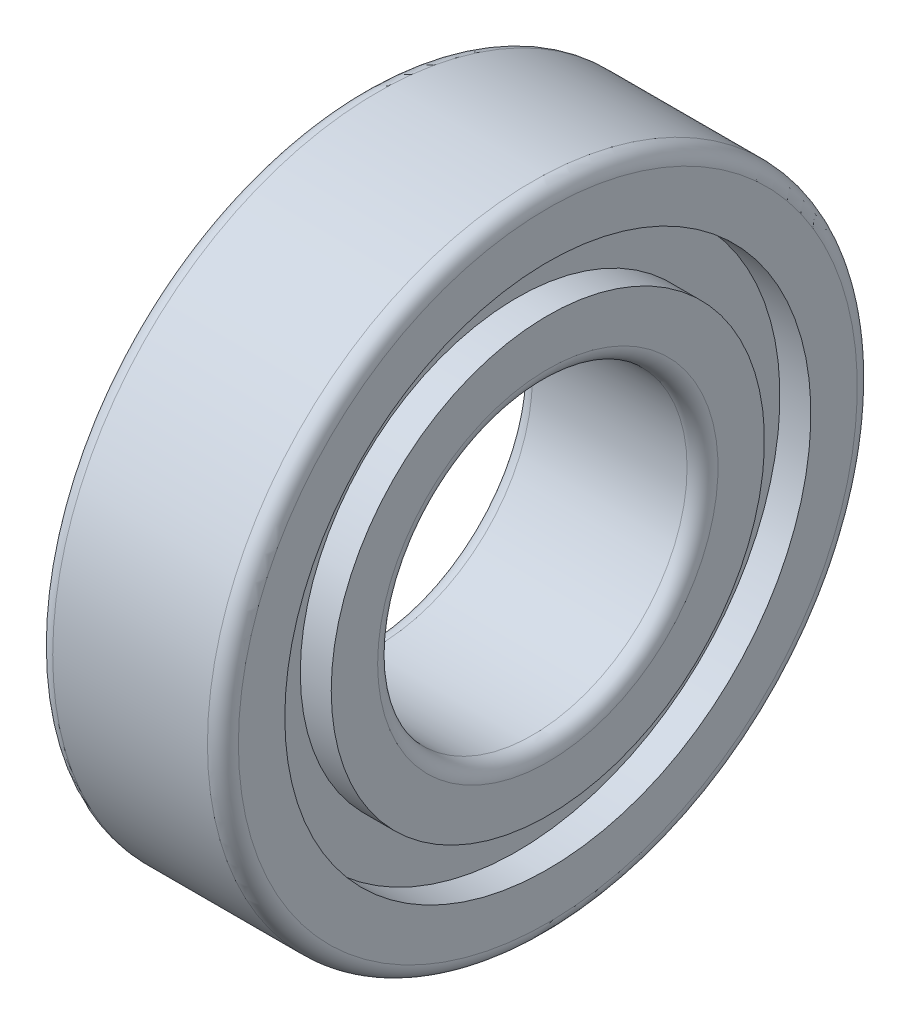
ISO-10303-21;
HEADER;
FILE_DESCRIPTION(('STEP AP214'),'2;1');
FILE_NAME('part.step','',(''),(''),'','','');
FILE_SCHEMA(('AUTOMOTIVE_DESIGN { 1 0 10303 214 1 1 1 1 }'));
ENDSEC;
DATA;
#1=APPLICATION_CONTEXT('core data for automotive mechanical design processes');
#2=APPLICATION_PROTOCOL_DEFINITION('international standard','automotive_design',2000,#1);
#3=PRODUCT_CONTEXT('',#1,'mechanical');
#4=PRODUCT('Part','Part','',(#3));
#5=PRODUCT_RELATED_PRODUCT_CATEGORY('part','',(#4));
#6=PRODUCT_DEFINITION_FORMATION('','',#4);
#7=PRODUCT_DEFINITION_CONTEXT('part definition',#1,'design');
#8=PRODUCT_DEFINITION('design','',#6,#7);
#9=PRODUCT_DEFINITION_SHAPE('','',#8);
#10=(LENGTH_UNIT() NAMED_UNIT(*) SI_UNIT(.MILLI.,.METRE.));
#11=(NAMED_UNIT(*) PLANE_ANGLE_UNIT() SI_UNIT($,.RADIAN.));
#12=(NAMED_UNIT(*) SI_UNIT($,.STERADIAN.) SOLID_ANGLE_UNIT());
#13=UNCERTAINTY_MEASURE_WITH_UNIT(LENGTH_MEASURE(1.E-05),#10,'distance_accuracy_value','');
#14=(GEOMETRIC_REPRESENTATION_CONTEXT(3) GLOBAL_UNCERTAINTY_ASSIGNED_CONTEXT((#13)) GLOBAL_UNIT_ASSIGNED_CONTEXT((#10,
#11,#12)) REPRESENTATION_CONTEXT('',''));
#15=CARTESIAN_POINT('',(0.,0.,0.));
#16=DIRECTION('',(0.,0.,1.));
#17=DIRECTION('',(1.,0.,0.));
#18=AXIS2_PLACEMENT_3D('',#15,#16,#17);
#19=CARTESIAN_POINT('',(-5.,0.,0.));
#20=DIRECTION('',(-1.,0.,0.));
#21=DIRECTION('',(0.,0.,1.));
#22=AXIS2_PLACEMENT_3D('',#19,#20,#21);
#23=TOROIDAL_SURFACE('',#22,11.,1.);
#24=CARTESIAN_POINT('',(-5.,0.,0.));
#25=DIRECTION('',(-1.,0.,0.));
#26=DIRECTION('',(0.,0.,1.));
#27=AXIS2_PLACEMENT_3D('',#24,#25,#26);
#28=CIRCLE('',#27,10.);
#29=CARTESIAN_POINT('',(-5.,0.,10.));
#30=VERTEX_POINT('',#29);
#31=EDGE_CURVE('E84',#30,#30,#28,.T.);
#32=ORIENTED_EDGE('',*,*,#31,.F.);
#33=EDGE_LOOP('',(#32));
#34=FACE_BOUND('',#33,.T.);
#35=CARTESIAN_POINT('',(-6.00000000000001,0.,0.));
#36=DIRECTION('',(-1.,0.,0.));
#37=DIRECTION('',(0.,0.,1.));
#38=AXIS2_PLACEMENT_3D('',#35,#36,#37);
#39=CIRCLE('',#38,11.);
#40=CARTESIAN_POINT('',(-6.00000000000001,0.,11.));
#41=VERTEX_POINT('',#40);
#42=EDGE_CURVE('E10',#41,#41,#39,.T.);
#43=ORIENTED_EDGE('',*,*,#42,.T.);
#44=EDGE_LOOP('',(#43));
#45=FACE_BOUND('',#44,.T.);
#46=ADVANCED_FACE('F32',(#34,#45),#23,.T.);
#47=CARTESIAN_POINT('',(-6.,11.,0.));
#48=DIRECTION('',(1.,0.,0.));
#49=DIRECTION('',(0.,0.,-1.));
#50=AXIS2_PLACEMENT_3D('',#47,#48,#49);
#51=PLANE('',#50);
#52=ORIENTED_EDGE('',*,*,#42,.F.);
#53=EDGE_LOOP('',(#52));
#54=FACE_BOUND('',#53,.T.);
#55=CARTESIAN_POINT('',(-6.00000000000001,0.,0.));
#56=DIRECTION('',(-1.,0.,0.));
#57=DIRECTION('',(0.,0.,1.));
#58=AXIS2_PLACEMENT_3D('',#55,#56,#57);
#59=CIRCLE('',#58,14.);
#60=CARTESIAN_POINT('',(-6.00000000000001,0.,14.));
#61=VERTEX_POINT('',#60);
#62=EDGE_CURVE('E38',#61,#61,#59,.T.);
#63=ORIENTED_EDGE('',*,*,#62,.T.);
#64=EDGE_LOOP('',(#63));
#65=FACE_BOUND('',#64,.T.);
#66=ADVANCED_FACE('F91',(#54,#65),#51,.F.);
#67=CARTESIAN_POINT('',(-1000.,0.,0.));
#68=DIRECTION('',(-1.,0.,0.));
#69=DIRECTION('',(0.,0.,1.));
#70=AXIS2_PLACEMENT_3D('',#67,#68,#69);
#71=CYLINDRICAL_SURFACE('',#70,14.);
#72=ORIENTED_EDGE('',*,*,#62,.F.);
#73=EDGE_LOOP('',(#72));
#74=FACE_BOUND('',#73,.T.);
#75=CARTESIAN_POINT('',(-4.,0.,0.));
#76=DIRECTION('',(-1.,0.,0.));
#77=DIRECTION('',(0.,0.,1.));
#78=AXIS2_PLACEMENT_3D('',#75,#76,#77);
#79=CIRCLE('',#78,14.);
#80=CARTESIAN_POINT('',(-4.,0.,14.));
#81=VERTEX_POINT('',#80);
#82=EDGE_CURVE('E42',#81,#81,#79,.T.);
#83=ORIENTED_EDGE('',*,*,#82,.T.);
#84=EDGE_LOOP('',(#83));
#85=FACE_BOUND('',#84,.T.);
#86=ADVANCED_FACE('F95',(#74,#85),#71,.T.);
#87=CARTESIAN_POINT('',(-4.,14.,0.));
#88=DIRECTION('',(1.,0.,0.));
#89=DIRECTION('',(0.,0.,-1.));
#90=AXIS2_PLACEMENT_3D('',#87,#88,#89);
#91=PLANE('',#90);
#92=ORIENTED_EDGE('',*,*,#82,.F.);
#93=EDGE_LOOP('',(#92));
#94=FACE_BOUND('',#93,.T.);
#95=CARTESIAN_POINT('',(-4.,0.,0.));
#96=DIRECTION('',(-1.,0.,0.));
#97=DIRECTION('',(0.,0.,1.));
#98=AXIS2_PLACEMENT_3D('',#95,#96,#97);
#99=CIRCLE('',#98,17.);
#100=CARTESIAN_POINT('',(-4.,0.,17.));
#101=VERTEX_POINT('',#100);
#102=EDGE_CURVE('E46',#101,#101,#99,.T.);
#103=ORIENTED_EDGE('',*,*,#102,.T.);
#104=EDGE_LOOP('',(#103));
#105=FACE_BOUND('',#104,.T.);
#106=ADVANCED_FACE('F100',(#94,#105),#91,.F.);
#107=CARTESIAN_POINT('',(-1000.,0.,0.));
#108=DIRECTION('',(-1.,0.,0.));
#109=DIRECTION('',(0.,0.,1.));
#110=AXIS2_PLACEMENT_3D('',#107,#108,#109);
#111=CYLINDRICAL_SURFACE('',#110,17.);
#112=ORIENTED_EDGE('',*,*,#102,.F.);
#113=EDGE_LOOP('',(#112));
#114=FACE_BOUND('',#113,.T.);
#115=CARTESIAN_POINT('',(-6.00000000000001,0.,0.));
#116=DIRECTION('',(-1.,0.,0.));
#117=DIRECTION('',(0.,0.,1.));
#118=AXIS2_PLACEMENT_3D('',#115,#116,#117);
#119=CIRCLE('',#118,17.);
#120=CARTESIAN_POINT('',(-6.00000000000001,0.,17.));
#121=VERTEX_POINT('',#120);
#122=EDGE_CURVE('E51',#121,#121,#119,.T.);
#123=ORIENTED_EDGE('',*,*,#122,.T.);
#124=EDGE_LOOP('',(#123));
#125=FACE_BOUND('',#124,.T.);
#126=ADVANCED_FACE('F106',(#114,#125),#111,.F.);
#127=CARTESIAN_POINT('',(-6.,17.,0.));
#128=DIRECTION('',(1.,0.,0.));
#129=DIRECTION('',(0.,0.,-1.));
#130=AXIS2_PLACEMENT_3D('',#127,#128,#129);
#131=PLANE('',#130);
#132=ORIENTED_EDGE('',*,*,#122,.F.);
#133=EDGE_LOOP('',(#132));
#134=FACE_BOUND('',#133,.T.);
#135=CARTESIAN_POINT('',(-6.00000000000001,0.,0.));
#136=DIRECTION('',(-1.,0.,0.));
#137=DIRECTION('',(0.,0.,1.));
#138=AXIS2_PLACEMENT_3D('',#135,#136,#137);
#139=CIRCLE('',#138,20.);
#140=CARTESIAN_POINT('',(-6.00000000000001,0.,20.));
#141=VERTEX_POINT('',#140);
#142=EDGE_CURVE('E54',#141,#141,#139,.T.);
#143=ORIENTED_EDGE('',*,*,#142,.T.);
#144=EDGE_LOOP('',(#143));
#145=FACE_BOUND('',#144,.T.);
#146=ADVANCED_FACE('F110',(#134,#145),#131,.F.);
#147=CARTESIAN_POINT('',(-5.,0.,0.));
#148=DIRECTION('',(-1.,0.,0.));
#149=DIRECTION('',(0.,0.,1.));
#150=AXIS2_PLACEMENT_3D('',#147,#148,#149);
#151=TOROIDAL_SURFACE('',#150,20.,0.999999999999999);
#152=ORIENTED_EDGE('',*,*,#142,.F.);
#153=EDGE_LOOP('',(#152));
#154=FACE_BOUND('',#153,.T.);
#155=CARTESIAN_POINT('',(-5.,0.,0.));
#156=DIRECTION('',(-1.,0.,0.));
#157=DIRECTION('',(0.,0.,1.));
#158=AXIS2_PLACEMENT_3D('',#155,#156,#157);
#159=CIRCLE('',#158,21.);
#160=CARTESIAN_POINT('',(-5.,0.,21.));
#161=VERTEX_POINT('',#160);
#162=EDGE_CURVE('E57',#161,#161,#159,.T.);
#163=ORIENTED_EDGE('',*,*,#162,.T.);
#164=EDGE_LOOP('',(#163));
#165=FACE_BOUND('',#164,.T.);
#166=ADVANCED_FACE('F114',(#154,#165),#151,.T.);
#167=CARTESIAN_POINT('',(-1000.,0.,0.));
#168=DIRECTION('',(-1.,0.,0.));
#169=DIRECTION('',(0.,0.,1.));
#170=AXIS2_PLACEMENT_3D('',#167,#168,#169);
#171=CYLINDRICAL_SURFACE('',#170,21.);
#172=ORIENTED_EDGE('',*,*,#162,.F.);
#173=EDGE_LOOP('',(#172));
#174=FACE_BOUND('',#173,.T.);
#175=CARTESIAN_POINT('',(4.99999999999989,0.,0.));
#176=DIRECTION('',(-1.,0.,0.));
#177=DIRECTION('',(0.,0.,1.));
#178=AXIS2_PLACEMENT_3D('',#175,#176,#177);
#179=CIRCLE('',#178,21.);
#180=CARTESIAN_POINT('',(4.99999999999989,0.,21.));
#181=VERTEX_POINT('',#180);
#182=EDGE_CURVE('E60',#181,#181,#179,.T.);
#183=ORIENTED_EDGE('',*,*,#182,.T.);
#184=EDGE_LOOP('',(#183));
#185=FACE_BOUND('',#184,.T.);
#186=ADVANCED_FACE('F118',(#174,#185),#171,.T.);
#187=CARTESIAN_POINT('',(5.,0.,0.));
#188=DIRECTION('',(-1.,0.,0.));
#189=DIRECTION('',(0.,0.,1.));
#190=AXIS2_PLACEMENT_3D('',#187,#188,#189);
#191=TOROIDAL_SURFACE('',#190,20.,0.999999999999999);
#192=ORIENTED_EDGE('',*,*,#182,.F.);
#193=EDGE_LOOP('',(#192));
#194=FACE_BOUND('',#193,.T.);
#195=CARTESIAN_POINT('',(6.00000000000001,0.,0.));
#196=DIRECTION('',(-1.,0.,0.));
#197=DIRECTION('',(0.,0.,1.));
#198=AXIS2_PLACEMENT_3D('',#195,#196,#197);
#199=CIRCLE('',#198,20.);
#200=CARTESIAN_POINT('',(6.00000000000001,0.,20.));
#201=VERTEX_POINT('',#200);
#202=EDGE_CURVE('E63',#201,#201,#199,.T.);
#203=ORIENTED_EDGE('',*,*,#202,.T.);
#204=EDGE_LOOP('',(#203));
#205=FACE_BOUND('',#204,.T.);
#206=ADVANCED_FACE('F122',(#194,#205),#191,.T.);
#207=CARTESIAN_POINT('',(6.,17.,0.));
#208=DIRECTION('',(-1.,0.,0.));
#209=DIRECTION('',(0.,0.,1.));
#210=AXIS2_PLACEMENT_3D('',#207,#208,#209);
#211=PLANE('',#210);
#212=ORIENTED_EDGE('',*,*,#202,.F.);
#213=EDGE_LOOP('',(#212));
#214=FACE_BOUND('',#213,.T.);
#215=CARTESIAN_POINT('',(6.00000000000001,0.,0.));
#216=DIRECTION('',(-1.,0.,0.));
#217=DIRECTION('',(0.,0.,1.));
#218=AXIS2_PLACEMENT_3D('',#215,#216,#217);
#219=CIRCLE('',#218,17.);
#220=CARTESIAN_POINT('',(6.00000000000001,0.,17.));
#221=VERTEX_POINT('',#220);
#222=EDGE_CURVE('E66',#221,#221,#219,.T.);
#223=ORIENTED_EDGE('',*,*,#222,.T.);
#224=EDGE_LOOP('',(#223));
#225=FACE_BOUND('',#224,.T.);
#226=ADVANCED_FACE('F126',(#214,#225),#211,.F.);
#227=CARTESIAN_POINT('',(-1000.,0.,0.));
#228=DIRECTION('',(-1.,0.,0.));
#229=DIRECTION('',(0.,0.,1.));
#230=AXIS2_PLACEMENT_3D('',#227,#228,#229);
#231=CYLINDRICAL_SURFACE('',#230,17.);
#232=ORIENTED_EDGE('',*,*,#222,.F.);
#233=EDGE_LOOP('',(#232));
#234=FACE_BOUND('',#233,.T.);
#235=CARTESIAN_POINT('',(4.,0.,0.));
#236=DIRECTION('',(-1.,0.,0.));
#237=DIRECTION('',(0.,0.,1.));
#238=AXIS2_PLACEMENT_3D('',#235,#236,#237);
#239=CIRCLE('',#238,17.);
#240=CARTESIAN_POINT('',(4.,0.,17.));
#241=VERTEX_POINT('',#240);
#242=EDGE_CURVE('E69',#241,#241,#239,.T.);
#243=ORIENTED_EDGE('',*,*,#242,.T.);
#244=EDGE_LOOP('',(#243));
#245=FACE_BOUND('',#244,.T.);
#246=ADVANCED_FACE('F130',(#234,#245),#231,.F.);
#247=CARTESIAN_POINT('',(4.,14.,0.));
#248=DIRECTION('',(-1.,0.,0.));
#249=DIRECTION('',(0.,0.,1.));
#250=AXIS2_PLACEMENT_3D('',#247,#248,#249);
#251=PLANE('',#250);
#252=ORIENTED_EDGE('',*,*,#242,.F.);
#253=EDGE_LOOP('',(#252));
#254=FACE_BOUND('',#253,.T.);
#255=CARTESIAN_POINT('',(4.,0.,0.));
#256=DIRECTION('',(-1.,0.,0.));
#257=DIRECTION('',(0.,0.,1.));
#258=AXIS2_PLACEMENT_3D('',#255,#256,#257);
#259=CIRCLE('',#258,14.);
#260=CARTESIAN_POINT('',(4.,0.,14.));
#261=VERTEX_POINT('',#260);
#262=EDGE_CURVE('E72',#261,#261,#259,.T.);
#263=ORIENTED_EDGE('',*,*,#262,.T.);
#264=EDGE_LOOP('',(#263));
#265=FACE_BOUND('',#264,.T.);
#266=ADVANCED_FACE('F134',(#254,#265),#251,.F.);
#267=CARTESIAN_POINT('',(-1000.,0.,0.));
#268=DIRECTION('',(-1.,0.,0.));
#269=DIRECTION('',(0.,0.,1.));
#270=AXIS2_PLACEMENT_3D('',#267,#268,#269);
#271=CYLINDRICAL_SURFACE('',#270,14.);
#272=ORIENTED_EDGE('',*,*,#262,.F.);
#273=EDGE_LOOP('',(#272));
#274=FACE_BOUND('',#273,.T.);
#275=CARTESIAN_POINT('',(6.00000000000001,0.,0.));
#276=DIRECTION('',(-1.,0.,0.));
#277=DIRECTION('',(0.,0.,1.));
#278=AXIS2_PLACEMENT_3D('',#275,#276,#277);
#279=CIRCLE('',#278,14.);
#280=CARTESIAN_POINT('',(6.00000000000001,0.,14.));
#281=VERTEX_POINT('',#280);
#282=EDGE_CURVE('E75',#281,#281,#279,.T.);
#283=ORIENTED_EDGE('',*,*,#282,.T.);
#284=EDGE_LOOP('',(#283));
#285=FACE_BOUND('',#284,.T.);
#286=ADVANCED_FACE('F138',(#274,#285),#271,.T.);
#287=CARTESIAN_POINT('',(6.,11.,0.));
#288=DIRECTION('',(-1.,0.,0.));
#289=DIRECTION('',(0.,0.,1.));
#290=AXIS2_PLACEMENT_3D('',#287,#288,#289);
#291=PLANE('',#290);
#292=ORIENTED_EDGE('',*,*,#282,.F.);
#293=EDGE_LOOP('',(#292));
#294=FACE_BOUND('',#293,.T.);
#295=CARTESIAN_POINT('',(6.00000000000001,0.,0.));
#296=DIRECTION('',(-1.,0.,0.));
#297=DIRECTION('',(0.,0.,1.));
#298=AXIS2_PLACEMENT_3D('',#295,#296,#297);
#299=CIRCLE('',#298,11.);
#300=CARTESIAN_POINT('',(6.00000000000001,0.,11.));
#301=VERTEX_POINT('',#300);
#302=EDGE_CURVE('E78',#301,#301,#299,.T.);
#303=ORIENTED_EDGE('',*,*,#302,.T.);
#304=EDGE_LOOP('',(#303));
#305=FACE_BOUND('',#304,.T.);
#306=ADVANCED_FACE('F142',(#294,#305),#291,.F.);
#307=CARTESIAN_POINT('',(5.,0.,0.));
#308=DIRECTION('',(-1.,0.,0.));
#309=DIRECTION('',(0.,0.,1.));
#310=AXIS2_PLACEMENT_3D('',#307,#308,#309);
#311=TOROIDAL_SURFACE('',#310,11.,1.);
#312=ORIENTED_EDGE('',*,*,#302,.F.);
#313=EDGE_LOOP('',(#312));
#314=FACE_BOUND('',#313,.T.);
#315=CARTESIAN_POINT('',(4.99999999999989,0.,0.));
#316=DIRECTION('',(-1.,0.,0.));
#317=DIRECTION('',(0.,0.,1.));
#318=AXIS2_PLACEMENT_3D('',#315,#316,#317);
#319=CIRCLE('',#318,10.);
#320=CARTESIAN_POINT('',(4.99999999999989,0.,10.));
#321=VERTEX_POINT('',#320);
#322=EDGE_CURVE('E81',#321,#321,#319,.T.);
#323=ORIENTED_EDGE('',*,*,#322,.T.);
#324=EDGE_LOOP('',(#323));
#325=FACE_BOUND('',#324,.T.);
#326=ADVANCED_FACE('F146',(#314,#325),#311,.T.);
#327=CARTESIAN_POINT('',(-1000.,0.,0.));
#328=DIRECTION('',(-1.,0.,0.));
#329=DIRECTION('',(0.,0.,1.));
#330=AXIS2_PLACEMENT_3D('',#327,#328,#329);
#331=CYLINDRICAL_SURFACE('',#330,10.);
#332=ORIENTED_EDGE('',*,*,#322,.F.);
#333=EDGE_LOOP('',(#332));
#334=FACE_BOUND('',#333,.T.);
#335=ORIENTED_EDGE('',*,*,#31,.T.);
#336=EDGE_LOOP('',(#335));
#337=FACE_BOUND('',#336,.T.);
#338=ADVANCED_FACE('F88',(#334,#337),#331,.F.);
#339=CLOSED_SHELL('',(#46,#66,#86,#106,#126,#146,#166,#186,#206,#226,#246,#266,#286,#306,#326,#338));
#340=MANIFOLD_SOLID_BREP('B2',#339);
#341=ADVANCED_BREP_SHAPE_REPRESENTATION('',(#18,#340),#14);
#342=SHAPE_DEFINITION_REPRESENTATION(#9,#341);
ENDSEC;
END-ISO-10303-21;
